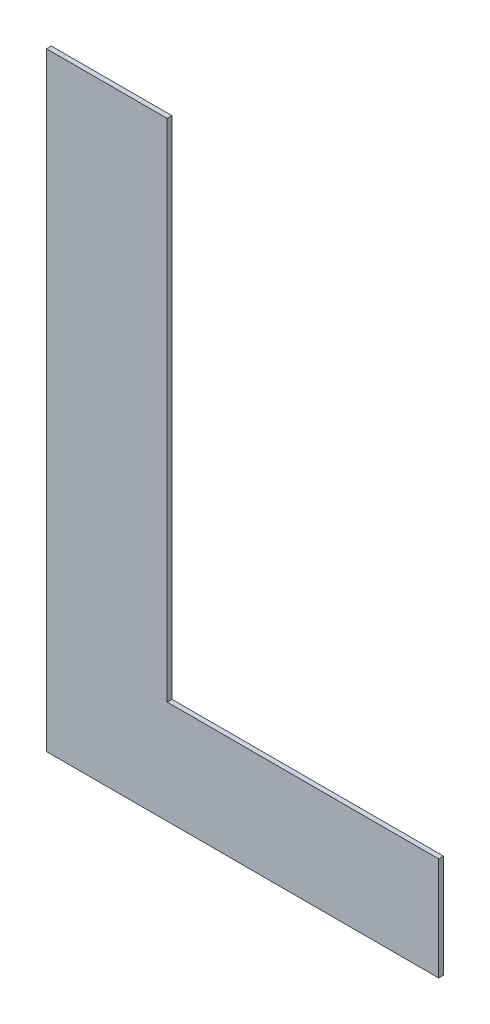
ISO-10303-21;
HEADER;
FILE_DESCRIPTION(('STEP AP214'),'2;1');
FILE_NAME('part.step','',(''),(''),'','','');
FILE_SCHEMA(('AUTOMOTIVE_DESIGN { 1 0 10303 214 1 1 1 1 }'));
ENDSEC;
DATA;
#1=APPLICATION_CONTEXT('core data for automotive mechanical design processes');
#2=APPLICATION_PROTOCOL_DEFINITION('international standard','automotive_design',2000,#1);
#3=PRODUCT_CONTEXT('',#1,'mechanical');
#4=PRODUCT('Part','Part','',(#3));
#5=PRODUCT_RELATED_PRODUCT_CATEGORY('part','',(#4));
#6=PRODUCT_DEFINITION_FORMATION('','',#4);
#7=PRODUCT_DEFINITION_CONTEXT('part definition',#1,'design');
#8=PRODUCT_DEFINITION('design','',#6,#7);
#9=PRODUCT_DEFINITION_SHAPE('','',#8);
#10=(LENGTH_UNIT() NAMED_UNIT(*) SI_UNIT(.MILLI.,.METRE.));
#11=(NAMED_UNIT(*) PLANE_ANGLE_UNIT() SI_UNIT($,.RADIAN.));
#12=(NAMED_UNIT(*) SI_UNIT($,.STERADIAN.) SOLID_ANGLE_UNIT());
#13=UNCERTAINTY_MEASURE_WITH_UNIT(LENGTH_MEASURE(1.E-05),#10,'distance_accuracy_value','');
#14=(GEOMETRIC_REPRESENTATION_CONTEXT(3) GLOBAL_UNCERTAINTY_ASSIGNED_CONTEXT((#13)) GLOBAL_UNIT_ASSIGNED_CONTEXT((#10,
#11,#12)) REPRESENTATION_CONTEXT('',''));
#15=CARTESIAN_POINT('',(0.,0.,0.));
#16=DIRECTION('',(0.,0.,1.));
#17=DIRECTION('',(1.,0.,0.));
#18=AXIS2_PLACEMENT_3D('',#15,#16,#17);
#19=CARTESIAN_POINT('',(-0.4143865120617,0.107055919785846,0.00086146168299));
#20=DIRECTION('',(-1.,0.,0.));
#21=DIRECTION('',(0.,0.,1.));
#22=AXIS2_PLACEMENT_3D('',#19,#20,#21);
#23=PLANE('',#22);
#24=DIRECTION('',(0.,0.,1.));
#25=VECTOR('',#24,1.);
#26=CARTESIAN_POINT('',(-0.4143865120617,0.031231074037092,-0.00033853831701));
#27=LINE('',#26,#25);
#28=CARTESIAN_POINT('',(-0.4143865120617,0.031231074037092,-0.00033853831701));
#29=VERTEX_POINT('',#28);
#30=CARTESIAN_POINT('',(-0.4143865120617,0.031231074037092,0.00086146168299));
#31=VERTEX_POINT('',#30);
#32=EDGE_CURVE('E11',#29,#31,#27,.T.);
#33=ORIENTED_EDGE('',*,*,#32,.T.);
#34=DIRECTION('',(0.,1.,0.));
#35=VECTOR('',#34,1.);
#36=CARTESIAN_POINT('',(-0.4143865120617,0.031231074037092,0.00086146168299));
#37=LINE('',#36,#35);
#38=CARTESIAN_POINT('',(-0.4143865120617,0.1828807655346,0.00086146168299));
#39=VERTEX_POINT('',#38);
#40=EDGE_CURVE('E24',#31,#39,#37,.T.);
#41=ORIENTED_EDGE('',*,*,#40,.T.);
#42=DIRECTION('',(0.,0.,1.));
#43=VECTOR('',#42,1.);
#44=CARTESIAN_POINT('',(-0.4143865120617,0.1828807655346,-0.00033853831701));
#45=LINE('',#44,#43);
#46=CARTESIAN_POINT('',(-0.4143865120617,0.1828807655346,-0.00033853831701));
#47=VERTEX_POINT('',#46);
#48=EDGE_CURVE('E113',#47,#39,#45,.T.);
#49=ORIENTED_EDGE('',*,*,#48,.F.);
#50=DIRECTION('',(0.,1.,0.));
#51=VECTOR('',#50,1.);
#52=CARTESIAN_POINT('',(-0.4143865120617,0.031231074037092,-0.00033853831701));
#53=LINE('',#52,#51);
#54=EDGE_CURVE('E111',#29,#47,#53,.T.);
#55=ORIENTED_EDGE('',*,*,#54,.F.);
#56=EDGE_LOOP('',(#33,#41,#49,#55));
#57=FACE_BOUND('',#56,.T.);
#58=ADVANCED_FACE('F17',(#57),#23,.T.);
#59=CARTESIAN_POINT('',(-0.3993587435485,0.1828807655346,0.00086146168299));
#60=DIRECTION('',(0.,1.,0.));
#61=DIRECTION('',(0.,0.,1.));
#62=AXIS2_PLACEMENT_3D('',#59,#60,#61);
#63=PLANE('',#62);
#64=ORIENTED_EDGE('',*,*,#48,.T.);
#65=DIRECTION('',(1.,0.,0.));
#66=VECTOR('',#65,1.);
#67=CARTESIAN_POINT('',(-0.4143865120617,0.1828807655346,0.00086146168299));
#68=LINE('',#67,#66);
#69=CARTESIAN_POINT('',(-0.3843309750353,0.1828807655346,0.00086146168299));
#70=VERTEX_POINT('',#69);
#71=EDGE_CURVE('E109',#39,#70,#68,.T.);
#72=ORIENTED_EDGE('',*,*,#71,.T.);
#73=DIRECTION('',(0.,0.,1.));
#74=VECTOR('',#73,1.);
#75=CARTESIAN_POINT('',(-0.3843309750353,0.1828807655346,-0.00033853831701));
#76=LINE('',#75,#74);
#77=CARTESIAN_POINT('',(-0.3843309750353,0.1828807655346,-0.00033853831701));
#78=VERTEX_POINT('',#77);
#79=EDGE_CURVE('E106',#78,#70,#76,.T.);
#80=ORIENTED_EDGE('',*,*,#79,.F.);
#81=DIRECTION('',(1.,0.,0.));
#82=VECTOR('',#81,1.);
#83=CARTESIAN_POINT('',(-0.4143865120617,0.1828807655346,-0.00033853831701));
#84=LINE('',#83,#82);
#85=EDGE_CURVE('E103',#47,#78,#84,.T.);
#86=ORIENTED_EDGE('',*,*,#85,.F.);
#87=EDGE_LOOP('',(#64,#72,#80,#86));
#88=FACE_BOUND('',#87,.T.);
#89=ADVANCED_FACE('F119',(#88),#63,.T.);
#90=CARTESIAN_POINT('',(-0.3843309750353,0.1199086355534,0.00086146168299));
#91=DIRECTION('',(1.,0.,0.));
#92=DIRECTION('',(0.,0.,-1.));
#93=AXIS2_PLACEMENT_3D('',#90,#91,#92);
#94=PLANE('',#93);
#95=ORIENTED_EDGE('',*,*,#79,.T.);
#96=DIRECTION('',(0.,-1.,0.));
#97=VECTOR('',#96,1.);
#98=CARTESIAN_POINT('',(-0.3843309750353,0.1828807655346,0.00086146168299));
#99=LINE('',#98,#97);
#100=CARTESIAN_POINT('',(-0.3843309750353,0.0569365055722,0.00086146168299));
#101=VERTEX_POINT('',#100);
#102=EDGE_CURVE('E101',#70,#101,#99,.T.);
#103=ORIENTED_EDGE('',*,*,#102,.T.);
#104=DIRECTION('',(0.,0.,1.));
#105=VECTOR('',#104,1.);
#106=CARTESIAN_POINT('',(-0.3843309750353,0.0569365055722,-0.00033853831701));
#107=LINE('',#106,#105);
#108=CARTESIAN_POINT('',(-0.3843309750353,0.0569365055722,-0.00033853831701));
#109=VERTEX_POINT('',#108);
#110=EDGE_CURVE('E98',#109,#101,#107,.T.);
#111=ORIENTED_EDGE('',*,*,#110,.F.);
#112=DIRECTION('',(0.,-1.,0.));
#113=VECTOR('',#112,1.);
#114=CARTESIAN_POINT('',(-0.3843309750353,0.1828807655346,-0.00033853831701));
#115=LINE('',#114,#113);
#116=EDGE_CURVE('E96',#78,#109,#115,.T.);
#117=ORIENTED_EDGE('',*,*,#116,.F.);
#118=EDGE_LOOP('',(#95,#103,#111,#117));
#119=FACE_BOUND('',#118,.T.);
#120=ADVANCED_FACE('F124',(#119),#94,.T.);
#121=CARTESIAN_POINT('',(-0.3505004336589,0.0569365055722,0.00086146168299));
#122=DIRECTION('',(0.,1.,0.));
#123=DIRECTION('',(0.,0.,1.));
#124=AXIS2_PLACEMENT_3D('',#121,#122,#123);
#125=PLANE('',#124);
#126=ORIENTED_EDGE('',*,*,#110,.T.);
#127=DIRECTION('',(1.,0.,0.));
#128=VECTOR('',#127,1.);
#129=CARTESIAN_POINT('',(-0.3843309750353,0.0569365055722,0.00086146168299));
#130=LINE('',#129,#128);
#131=CARTESIAN_POINT('',(-0.3166698922825,0.0569365055722,0.00086146168299));
#132=VERTEX_POINT('',#131);
#133=EDGE_CURVE('E94',#101,#132,#130,.T.);
#134=ORIENTED_EDGE('',*,*,#133,.T.);
#135=DIRECTION('',(0.,0.,1.));
#136=VECTOR('',#135,1.);
#137=CARTESIAN_POINT('',(-0.3166698922825,0.0569365055722,-0.00033853831701));
#138=LINE('',#137,#136);
#139=CARTESIAN_POINT('',(-0.3166698922825,0.0569365055722,-0.00033853831701));
#140=VERTEX_POINT('',#139);
#141=EDGE_CURVE('E92',#140,#132,#138,.T.);
#142=ORIENTED_EDGE('',*,*,#141,.F.);
#143=DIRECTION('',(1.,0.,0.));
#144=VECTOR('',#143,1.);
#145=CARTESIAN_POINT('',(-0.3843309750353,0.0569365055722,-0.00033853831701));
#146=LINE('',#145,#144);
#147=EDGE_CURVE('E83',#109,#140,#146,.T.);
#148=ORIENTED_EDGE('',*,*,#147,.F.);
#149=EDGE_LOOP('',(#126,#134,#142,#148));
#150=FACE_BOUND('',#149,.T.);
#151=ADVANCED_FACE('F127',(#150),#125,.T.);
#152=CARTESIAN_POINT('',(-0.3166698922825,0.044083789804646,0.00086146168299));
#153=DIRECTION('',(1.,0.,0.));
#154=DIRECTION('',(0.,0.,-1.));
#155=AXIS2_PLACEMENT_3D('',#152,#153,#154);
#156=PLANE('',#155);
#157=ORIENTED_EDGE('',*,*,#141,.T.);
#158=DIRECTION('',(0.,-1.,0.));
#159=VECTOR('',#158,1.);
#160=CARTESIAN_POINT('',(-0.3166698922825,0.0569365055722,0.00086146168299));
#161=LINE('',#160,#159);
#162=CARTESIAN_POINT('',(-0.3166698922825,0.031231074037092,0.00086146168299));
#163=VERTEX_POINT('',#162);
#164=EDGE_CURVE('E72',#132,#163,#161,.T.);
#165=ORIENTED_EDGE('',*,*,#164,.T.);
#166=DIRECTION('',(0.,0.,1.));
#167=VECTOR('',#166,1.);
#168=CARTESIAN_POINT('',(-0.3166698922825,0.031231074037092,-0.00033853831701));
#169=LINE('',#168,#167);
#170=CARTESIAN_POINT('',(-0.3166698922825,0.031231074037092,-0.00033853831701));
#171=VERTEX_POINT('',#170);
#172=EDGE_CURVE('E66',#171,#163,#169,.T.);
#173=ORIENTED_EDGE('',*,*,#172,.F.);
#174=DIRECTION('',(0.,-1.,0.));
#175=VECTOR('',#174,1.);
#176=CARTESIAN_POINT('',(-0.3166698922825,0.0569365055722,-0.00033853831701));
#177=LINE('',#176,#175);
#178=EDGE_CURVE('E70',#140,#171,#177,.T.);
#179=ORIENTED_EDGE('',*,*,#178,.F.);
#180=EDGE_LOOP('',(#157,#165,#173,#179));
#181=FACE_BOUND('',#180,.T.);
#182=ADVANCED_FACE('F69',(#181),#156,.T.);
#183=CARTESIAN_POINT('',(-0.3655282021721,0.031231074037092,0.00086146168299));
#184=DIRECTION('',(0.,-1.,0.));
#185=DIRECTION('',(0.,0.,-1.));
#186=AXIS2_PLACEMENT_3D('',#183,#184,#185);
#187=PLANE('',#186);
#188=ORIENTED_EDGE('',*,*,#172,.T.);
#189=DIRECTION('',(-1.,0.,0.));
#190=VECTOR('',#189,1.);
#191=CARTESIAN_POINT('',(-0.3166698922825,0.031231074037092,0.00086146168299));
#192=LINE('',#191,#190);
#193=EDGE_CURVE('E84',#163,#31,#192,.T.);
#194=ORIENTED_EDGE('',*,*,#193,.T.);
#195=ORIENTED_EDGE('',*,*,#32,.F.);
#196=DIRECTION('',(-1.,0.,0.));
#197=VECTOR('',#196,1.);
#198=CARTESIAN_POINT('',(-0.3166698922825,0.031231074037092,-0.00033853831701));
#199=LINE('',#198,#197);
#200=EDGE_CURVE('E80',#171,#29,#199,.T.);
#201=ORIENTED_EDGE('',*,*,#200,.F.);
#202=EDGE_LOOP('',(#188,#194,#195,#201));
#203=FACE_BOUND('',#202,.T.);
#204=ADVANCED_FACE('F86',(#203),#187,.T.);
#205=CARTESIAN_POINT('',(-0.3655282021721,0.031231074037092,-0.00033853831701));
#206=DIRECTION('',(0.,0.,1.));
#207=DIRECTION('',(1.,0.,0.));
#208=AXIS2_PLACEMENT_3D('',#205,#206,#207);
#209=PLANE('',#208);
#210=ORIENTED_EDGE('',*,*,#54,.T.);
#211=ORIENTED_EDGE('',*,*,#85,.T.);
#212=ORIENTED_EDGE('',*,*,#116,.T.);
#213=ORIENTED_EDGE('',*,*,#147,.T.);
#214=ORIENTED_EDGE('',*,*,#178,.T.);
#215=ORIENTED_EDGE('',*,*,#200,.T.);
#216=EDGE_LOOP('',(#210,#211,#212,#213,#214,#215));
#217=FACE_BOUND('',#216,.T.);
#218=ADVANCED_FACE('F79',(#217),#209,.F.);
#219=CARTESIAN_POINT('',(-0.3655282021721,0.031231074037092,0.00086146168299));
#220=DIRECTION('',(0.,0.,1.));
#221=DIRECTION('',(1.,0.,0.));
#222=AXIS2_PLACEMENT_3D('',#219,#220,#221);
#223=PLANE('',#222);
#224=ORIENTED_EDGE('',*,*,#40,.F.);
#225=ORIENTED_EDGE('',*,*,#193,.F.);
#226=ORIENTED_EDGE('',*,*,#164,.F.);
#227=ORIENTED_EDGE('',*,*,#133,.F.);
#228=ORIENTED_EDGE('',*,*,#102,.F.);
#229=ORIENTED_EDGE('',*,*,#71,.F.);
#230=EDGE_LOOP('',(#224,#225,#226,#227,#228,#229));
#231=FACE_BOUND('',#230,.T.);
#232=ADVANCED_FACE('F121',(#231),#223,.T.);
#233=CLOSED_SHELL('',(#58,#89,#120,#151,#182,#204,#218,#232));
#234=MANIFOLD_SOLID_BREP('B1',#233);
#235=ADVANCED_BREP_SHAPE_REPRESENTATION('',(#18,#234),#14);
#236=SHAPE_DEFINITION_REPRESENTATION(#9,#235);
ENDSEC;
END-ISO-10303-21;
